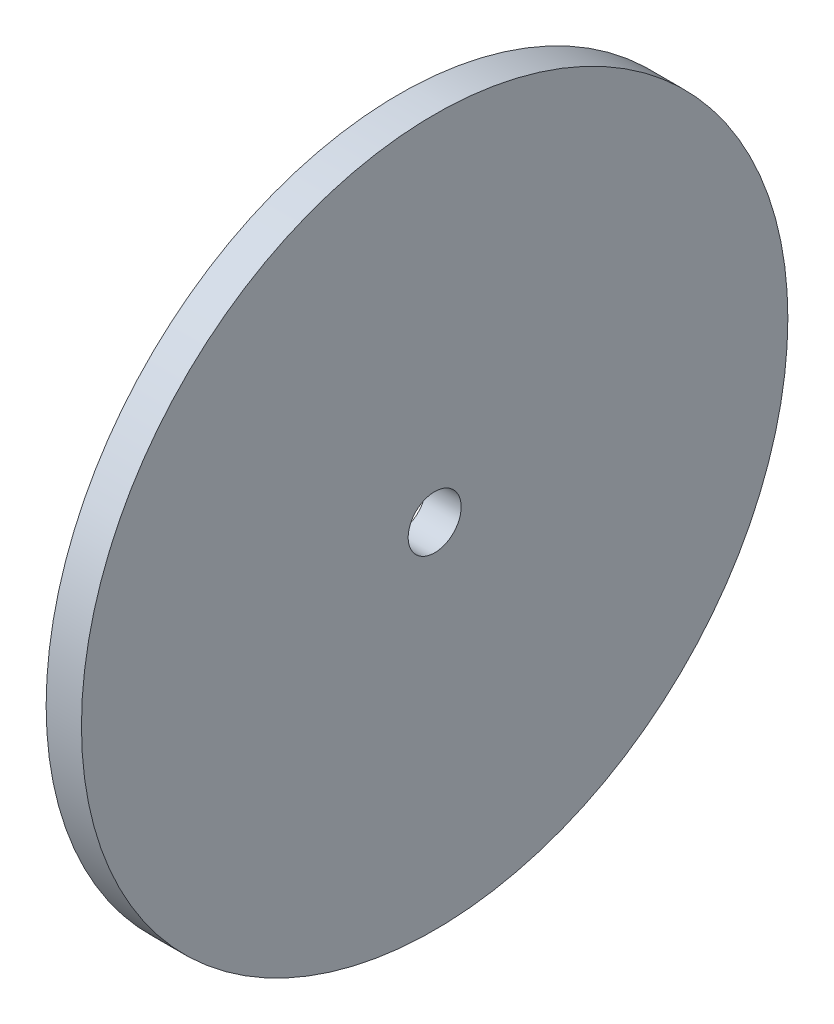
ISO-10303-21;
HEADER;
FILE_DESCRIPTION(('STEP AP214'),'2;1');
FILE_NAME('part.step','',(''),(''),'','','');
FILE_SCHEMA(('AUTOMOTIVE_DESIGN { 1 0 10303 214 1 1 1 1 }'));
ENDSEC;
DATA;
#1=APPLICATION_CONTEXT('core data for automotive mechanical design processes');
#2=APPLICATION_PROTOCOL_DEFINITION('international standard','automotive_design',2000,#1);
#3=PRODUCT_CONTEXT('',#1,'mechanical');
#4=PRODUCT('Part','Part','',(#3));
#5=PRODUCT_RELATED_PRODUCT_CATEGORY('part','',(#4));
#6=PRODUCT_DEFINITION_FORMATION('','',#4);
#7=PRODUCT_DEFINITION_CONTEXT('part definition',#1,'design');
#8=PRODUCT_DEFINITION('design','',#6,#7);
#9=PRODUCT_DEFINITION_SHAPE('','',#8);
#10=(LENGTH_UNIT() NAMED_UNIT(*) SI_UNIT(.MILLI.,.METRE.));
#11=(NAMED_UNIT(*) PLANE_ANGLE_UNIT() SI_UNIT($,.RADIAN.));
#12=(NAMED_UNIT(*) SI_UNIT($,.STERADIAN.) SOLID_ANGLE_UNIT());
#13=UNCERTAINTY_MEASURE_WITH_UNIT(LENGTH_MEASURE(1.E-05),#10,'distance_accuracy_value','');
#14=(GEOMETRIC_REPRESENTATION_CONTEXT(3) GLOBAL_UNCERTAINTY_ASSIGNED_CONTEXT((#13)) GLOBAL_UNIT_ASSIGNED_CONTEXT((#10,
#11,#12)) REPRESENTATION_CONTEXT('',''));
#15=CARTESIAN_POINT('',(0.,0.,0.));
#16=DIRECTION('',(0.,0.,1.));
#17=DIRECTION('',(1.,0.,0.));
#18=AXIS2_PLACEMENT_3D('',#15,#16,#17);
#19=CARTESIAN_POINT('',(2.,0.,0.));
#20=DIRECTION('',(-1.,0.,0.));
#21=DIRECTION('',(0.,0.,1.));
#22=AXIS2_PLACEMENT_3D('',#19,#20,#21);
#23=CYLINDRICAL_SURFACE('',#22,20.);
#24=CARTESIAN_POINT('',(2.,0.,0.));
#25=DIRECTION('',(1.,0.,0.));
#26=DIRECTION('',(0.,0.,-1.));
#27=AXIS2_PLACEMENT_3D('',#24,#25,#26);
#28=CIRCLE('',#27,20.);
#29=CARTESIAN_POINT('',(2.,0.,-20.));
#30=VERTEX_POINT('',#29);
#31=EDGE_CURVE('E10',#30,#30,#28,.T.);
#32=ORIENTED_EDGE('',*,*,#31,.F.);
#33=EDGE_LOOP('',(#32));
#34=FACE_BOUND('',#33,.T.);
#35=CARTESIAN_POINT('',(0.,0.,0.));
#36=DIRECTION('',(1.,0.,0.));
#37=DIRECTION('',(0.,0.,-1.));
#38=AXIS2_PLACEMENT_3D('',#35,#36,#37);
#39=CIRCLE('',#38,20.);
#40=CARTESIAN_POINT('',(0.,0.,-20.));
#41=VERTEX_POINT('',#40);
#42=EDGE_CURVE('E34',#41,#41,#39,.T.);
#43=ORIENTED_EDGE('',*,*,#42,.T.);
#44=EDGE_LOOP('',(#43));
#45=FACE_BOUND('',#44,.T.);
#46=ADVANCED_FACE('F31',(#34,#45),#23,.T.);
#47=CARTESIAN_POINT('',(2.,0.,0.));
#48=DIRECTION('',(1.,0.,0.));
#49=DIRECTION('',(0.,0.,-1.));
#50=AXIS2_PLACEMENT_3D('',#47,#48,#49);
#51=PLANE('',#50);
#52=CARTESIAN_POINT('',(2.,0.,0.));
#53=DIRECTION('',(1.,0.,0.));
#54=DIRECTION('',(0.,0.,-1.));
#55=AXIS2_PLACEMENT_3D('',#52,#53,#54);
#56=CIRCLE('',#55,1.5);
#57=CARTESIAN_POINT('',(2.,0.,-1.5));
#58=VERTEX_POINT('',#57);
#59=EDGE_CURVE('E43',#58,#58,#56,.T.);
#60=ORIENTED_EDGE('',*,*,#59,.F.);
#61=EDGE_LOOP('',(#60));
#62=FACE_BOUND('',#61,.T.);
#63=ORIENTED_EDGE('',*,*,#31,.T.);
#64=EDGE_LOOP('',(#63));
#65=FACE_BOUND('',#64,.T.);
#66=ADVANCED_FACE('F58',(#62,#65),#51,.T.);
#67=CARTESIAN_POINT('',(0.,0.,0.));
#68=DIRECTION('',(1.,0.,0.));
#69=DIRECTION('',(0.,0.,-1.));
#70=AXIS2_PLACEMENT_3D('',#67,#68,#69);
#71=PLANE('',#70);
#72=CARTESIAN_POINT('',(0.,0.,0.));
#73=DIRECTION('',(1.,0.,0.));
#74=DIRECTION('',(0.,0.,-1.));
#75=AXIS2_PLACEMENT_3D('',#72,#73,#74);
#76=CIRCLE('',#75,1.5);
#77=CARTESIAN_POINT('',(0.,0.,-1.5));
#78=VERTEX_POINT('',#77);
#79=EDGE_CURVE('E41',#78,#78,#76,.T.);
#80=ORIENTED_EDGE('',*,*,#79,.T.);
#81=EDGE_LOOP('',(#80));
#82=FACE_BOUND('',#81,.T.);
#83=ORIENTED_EDGE('',*,*,#42,.F.);
#84=EDGE_LOOP('',(#83));
#85=FACE_BOUND('',#84,.T.);
#86=ADVANCED_FACE('F49',(#82,#85),#71,.F.);
#87=CARTESIAN_POINT('',(0.,0.,0.));
#88=DIRECTION('',(1.,0.,0.));
#89=DIRECTION('',(0.,0.,-1.));
#90=AXIS2_PLACEMENT_3D('',#87,#88,#89);
#91=CYLINDRICAL_SURFACE('',#90,1.5);
#92=ORIENTED_EDGE('',*,*,#79,.F.);
#93=EDGE_LOOP('',(#92));
#94=FACE_BOUND('',#93,.T.);
#95=ORIENTED_EDGE('',*,*,#59,.T.);
#96=EDGE_LOOP('',(#95));
#97=FACE_BOUND('',#96,.T.);
#98=ADVANCED_FACE('F52',(#94,#97),#91,.F.);
#99=CLOSED_SHELL('',(#46,#66,#86,#98));
#100=MANIFOLD_SOLID_BREP('B2',#99);
#101=ADVANCED_BREP_SHAPE_REPRESENTATION('',(#18,#100),#14);
#102=SHAPE_DEFINITION_REPRESENTATION(#9,#101);
ENDSEC;
END-ISO-10303-21;
